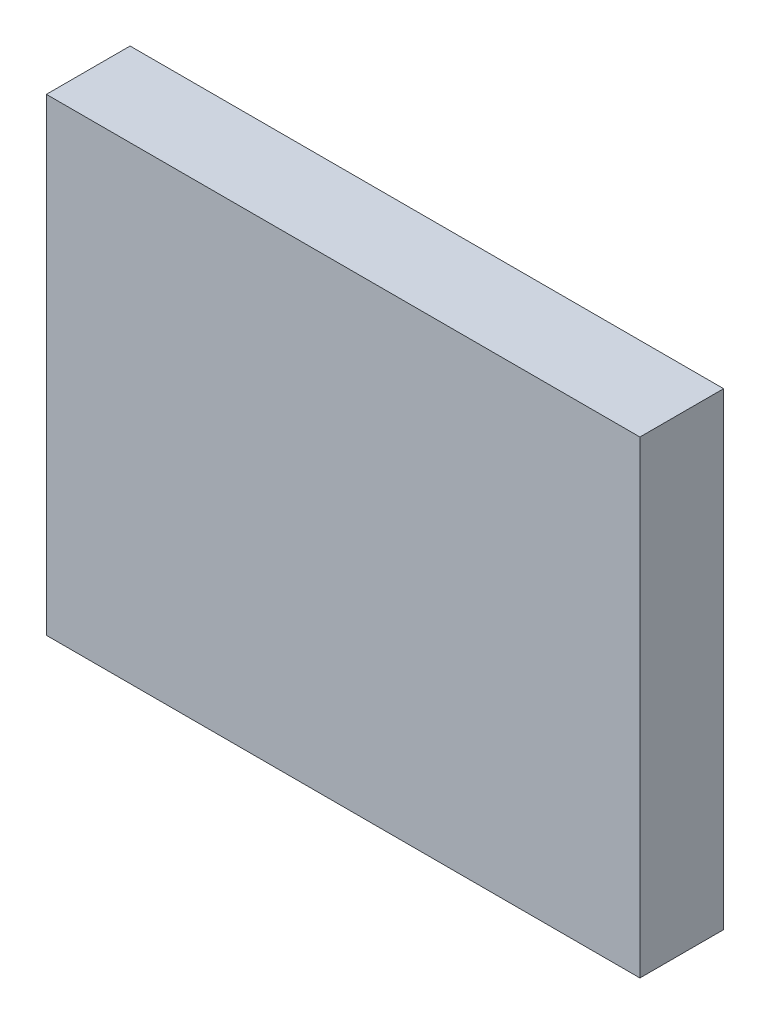
ISO-10303-21;
HEADER;
FILE_DESCRIPTION(('STEP AP214'),'2;1');
FILE_NAME('part.step','',(''),(''),'','','');
FILE_SCHEMA(('AUTOMOTIVE_DESIGN { 1 0 10303 214 1 1 1 1 }'));
ENDSEC;
DATA;
#1=APPLICATION_CONTEXT('core data for automotive mechanical design processes');
#2=APPLICATION_PROTOCOL_DEFINITION('international standard','automotive_design',2000,#1);
#3=PRODUCT_CONTEXT('',#1,'mechanical');
#4=PRODUCT('Part','Part','',(#3));
#5=PRODUCT_RELATED_PRODUCT_CATEGORY('part','',(#4));
#6=PRODUCT_DEFINITION_FORMATION('','',#4);
#7=PRODUCT_DEFINITION_CONTEXT('part definition',#1,'design');
#8=PRODUCT_DEFINITION('design','',#6,#7);
#9=PRODUCT_DEFINITION_SHAPE('','',#8);
#10=(LENGTH_UNIT() NAMED_UNIT(*) SI_UNIT(.MILLI.,.METRE.));
#11=(NAMED_UNIT(*) PLANE_ANGLE_UNIT() SI_UNIT($,.RADIAN.));
#12=(NAMED_UNIT(*) SI_UNIT($,.STERADIAN.) SOLID_ANGLE_UNIT());
#13=UNCERTAINTY_MEASURE_WITH_UNIT(LENGTH_MEASURE(1.E-05),#10,'distance_accuracy_value','');
#14=(GEOMETRIC_REPRESENTATION_CONTEXT(3) GLOBAL_UNCERTAINTY_ASSIGNED_CONTEXT((#13)) GLOBAL_UNIT_ASSIGNED_CONTEXT((#10,
#11,#12)) REPRESENTATION_CONTEXT('',''));
#15=CARTESIAN_POINT('',(0.,0.,0.));
#16=DIRECTION('',(0.,0.,1.));
#17=DIRECTION('',(1.,0.,0.));
#18=AXIS2_PLACEMENT_3D('',#15,#16,#17);
#19=CARTESIAN_POINT('',(-70.9052769482113,55.9707888249795,10.));
#20=DIRECTION('',(1.,0.,0.));
#21=DIRECTION('',(0.,0.,-1.));
#22=AXIS2_PLACEMENT_3D('',#19,#20,#21);
#23=PLANE('',#22);
#24=DIRECTION('',(0.,-1.,0.));
#25=VECTOR('',#24,1.);
#26=CARTESIAN_POINT('',(-70.9052769482113,55.9707888249795,0.));
#27=LINE('',#26,#25);
#28=CARTESIAN_POINT('',(-70.9052769482113,55.9707888249795,0.));
#29=VERTEX_POINT('',#28);
#30=CARTESIAN_POINT('',(-70.9052769482113,0.,0.));
#31=VERTEX_POINT('',#30);
#32=EDGE_CURVE('E95',#29,#31,#27,.T.);
#33=ORIENTED_EDGE('',*,*,#32,.T.);
#34=DIRECTION('',(0.,0.,-1.));
#35=VECTOR('',#34,1.);
#36=CARTESIAN_POINT('',(-70.9052769482113,0.,10.));
#37=LINE('',#36,#35);
#38=CARTESIAN_POINT('',(-70.9052769482113,0.,10.));
#39=VERTEX_POINT('',#38);
#40=EDGE_CURVE('E11',#39,#31,#37,.T.);
#41=ORIENTED_EDGE('',*,*,#40,.F.);
#42=DIRECTION('',(0.,-1.,0.));
#43=VECTOR('',#42,1.);
#44=CARTESIAN_POINT('',(-70.9052769482113,55.9707888249795,10.));
#45=LINE('',#44,#43);
#46=CARTESIAN_POINT('',(-70.9052769482113,55.9707888249795,10.));
#47=VERTEX_POINT('',#46);
#48=EDGE_CURVE('E83',#47,#39,#45,.T.);
#49=ORIENTED_EDGE('',*,*,#48,.F.);
#50=DIRECTION('',(0.,0.,-1.));
#51=VECTOR('',#50,1.);
#52=CARTESIAN_POINT('',(-70.9052769482113,55.9707888249795,10.));
#53=LINE('',#52,#51);
#54=EDGE_CURVE('E91',#47,#29,#53,.T.);
#55=ORIENTED_EDGE('',*,*,#54,.T.);
#56=EDGE_LOOP('',(#33,#41,#49,#55));
#57=FACE_BOUND('',#56,.T.);
#58=ADVANCED_FACE('F32',(#57),#23,.F.);
#59=CARTESIAN_POINT('',(-70.9052769482113,0.,10.));
#60=DIRECTION('',(0.,1.,0.));
#61=DIRECTION('',(0.,0.,1.));
#62=AXIS2_PLACEMENT_3D('',#59,#60,#61);
#63=PLANE('',#62);
#64=DIRECTION('',(1.,0.,0.));
#65=VECTOR('',#64,1.);
#66=CARTESIAN_POINT('',(-70.9052769482113,0.,0.));
#67=LINE('',#66,#65);
#68=CARTESIAN_POINT('',(0.,0.,0.));
#69=VERTEX_POINT('',#68);
#70=EDGE_CURVE('E87',#31,#69,#67,.T.);
#71=ORIENTED_EDGE('',*,*,#70,.T.);
#72=DIRECTION('',(0.,0.,-1.));
#73=VECTOR('',#72,1.);
#74=CARTESIAN_POINT('',(0.,0.,10.));
#75=LINE('',#74,#73);
#76=CARTESIAN_POINT('',(0.,0.,10.));
#77=VERTEX_POINT('',#76);
#78=EDGE_CURVE('E40',#77,#69,#75,.T.);
#79=ORIENTED_EDGE('',*,*,#78,.F.);
#80=DIRECTION('',(1.,0.,0.));
#81=VECTOR('',#80,1.);
#82=CARTESIAN_POINT('',(-70.9052769482113,0.,10.));
#83=LINE('',#82,#81);
#84=EDGE_CURVE('E78',#39,#77,#83,.T.);
#85=ORIENTED_EDGE('',*,*,#84,.F.);
#86=ORIENTED_EDGE('',*,*,#40,.T.);
#87=EDGE_LOOP('',(#71,#79,#85,#86));
#88=FACE_BOUND('',#87,.T.);
#89=ADVANCED_FACE('F86',(#88),#63,.F.);
#90=CARTESIAN_POINT('',(0.,55.9707888249795,10.));
#91=DIRECTION('',(-1.,0.,0.));
#92=DIRECTION('',(0.,0.,1.));
#93=AXIS2_PLACEMENT_3D('',#90,#91,#92);
#94=PLANE('',#93);
#95=DIRECTION('',(0.,1.,0.));
#96=VECTOR('',#95,1.);
#97=CARTESIAN_POINT('',(0.,55.9707888249795,0.));
#98=LINE('',#97,#96);
#99=CARTESIAN_POINT('',(0.,55.9707888249795,0.));
#100=VERTEX_POINT('',#99);
#101=EDGE_CURVE('E65',#69,#100,#98,.T.);
#102=ORIENTED_EDGE('',*,*,#101,.T.);
#103=DIRECTION('',(0.,0.,-1.));
#104=VECTOR('',#103,1.);
#105=CARTESIAN_POINT('',(0.,55.9707888249795,10.));
#106=LINE('',#105,#104);
#107=CARTESIAN_POINT('',(0.,55.9707888249795,10.));
#108=VERTEX_POINT('',#107);
#109=EDGE_CURVE('E88',#108,#100,#106,.T.);
#110=ORIENTED_EDGE('',*,*,#109,.F.);
#111=DIRECTION('',(0.,1.,0.));
#112=VECTOR('',#111,1.);
#113=CARTESIAN_POINT('',(0.,55.9707888249795,10.));
#114=LINE('',#113,#112);
#115=EDGE_CURVE('E81',#77,#108,#114,.T.);
#116=ORIENTED_EDGE('',*,*,#115,.F.);
#117=ORIENTED_EDGE('',*,*,#78,.T.);
#118=EDGE_LOOP('',(#102,#110,#116,#117));
#119=FACE_BOUND('',#118,.T.);
#120=ADVANCED_FACE('F89',(#119),#94,.F.);
#121=CARTESIAN_POINT('',(-70.9052769482113,55.9707888249795,10.));
#122=DIRECTION('',(0.,-1.,0.));
#123=DIRECTION('',(0.,0.,-1.));
#124=AXIS2_PLACEMENT_3D('',#121,#122,#123);
#125=PLANE('',#124);
#126=DIRECTION('',(-1.,0.,0.));
#127=VECTOR('',#126,1.);
#128=CARTESIAN_POINT('',(-70.9052769482113,55.9707888249795,0.));
#129=LINE('',#128,#127);
#130=EDGE_CURVE('E71',#100,#29,#129,.T.);
#131=ORIENTED_EDGE('',*,*,#130,.T.);
#132=ORIENTED_EDGE('',*,*,#54,.F.);
#133=DIRECTION('',(-1.,0.,0.));
#134=VECTOR('',#133,1.);
#135=CARTESIAN_POINT('',(-70.9052769482113,55.9707888249795,10.));
#136=LINE('',#135,#134);
#137=EDGE_CURVE('E48',#108,#47,#136,.T.);
#138=ORIENTED_EDGE('',*,*,#137,.F.);
#139=ORIENTED_EDGE('',*,*,#109,.T.);
#140=EDGE_LOOP('',(#131,#132,#138,#139));
#141=FACE_BOUND('',#140,.T.);
#142=ADVANCED_FACE('F102',(#141),#125,.F.);
#143=CARTESIAN_POINT('',(0.,0.,10.));
#144=DIRECTION('',(0.,0.,1.));
#145=DIRECTION('',(1.,0.,0.));
#146=AXIS2_PLACEMENT_3D('',#143,#144,#145);
#147=PLANE('',#146);
#148=ORIENTED_EDGE('',*,*,#48,.T.);
#149=ORIENTED_EDGE('',*,*,#84,.T.);
#150=ORIENTED_EDGE('',*,*,#115,.T.);
#151=ORIENTED_EDGE('',*,*,#137,.T.);
#152=EDGE_LOOP('',(#148,#149,#150,#151));
#153=FACE_BOUND('',#152,.T.);
#154=ADVANCED_FACE('F79',(#153),#147,.T.);
#155=CARTESIAN_POINT('',(0.,0.,0.));
#156=DIRECTION('',(0.,0.,1.));
#157=DIRECTION('',(1.,0.,0.));
#158=AXIS2_PLACEMENT_3D('',#155,#156,#157);
#159=PLANE('',#158);
#160=ORIENTED_EDGE('',*,*,#32,.F.);
#161=ORIENTED_EDGE('',*,*,#130,.F.);
#162=ORIENTED_EDGE('',*,*,#101,.F.);
#163=ORIENTED_EDGE('',*,*,#70,.F.);
#164=EDGE_LOOP('',(#160,#161,#162,#163));
#165=FACE_BOUND('',#164,.T.);
#166=ADVANCED_FACE('F105',(#165),#159,.F.);
#167=CLOSED_SHELL('',(#58,#89,#120,#142,#154,#166));
#168=MANIFOLD_SOLID_BREP('B2',#167);
#169=ADVANCED_BREP_SHAPE_REPRESENTATION('',(#18,#168),#14);
#170=SHAPE_DEFINITION_REPRESENTATION(#9,#169);
ENDSEC;
END-ISO-10303-21;
